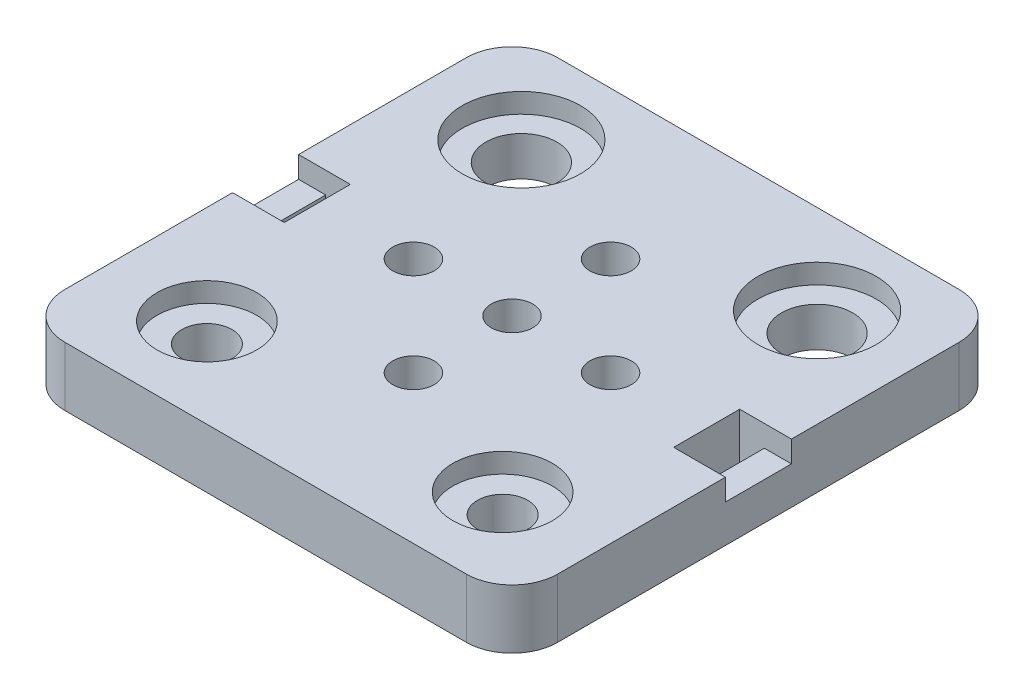
ISO-10303-21;
HEADER;
FILE_DESCRIPTION(('STEP AP214'),'2;1');
FILE_NAME('part.step','',(''),(''),'','','');
FILE_SCHEMA(('AUTOMOTIVE_DESIGN { 1 0 10303 214 1 1 1 1 }'));
ENDSEC;
DATA;
#1=APPLICATION_CONTEXT('core data for automotive mechanical design processes');
#2=APPLICATION_PROTOCOL_DEFINITION('international standard','automotive_design',2000,#1);
#3=PRODUCT_CONTEXT('',#1,'mechanical');
#4=PRODUCT('Part','Part','',(#3));
#5=PRODUCT_RELATED_PRODUCT_CATEGORY('part','',(#4));
#6=PRODUCT_DEFINITION_FORMATION('','',#4);
#7=PRODUCT_DEFINITION_CONTEXT('part definition',#1,'design');
#8=PRODUCT_DEFINITION('design','',#6,#7);
#9=PRODUCT_DEFINITION_SHAPE('','',#8);
#10=(LENGTH_UNIT() NAMED_UNIT(*) SI_UNIT(.MILLI.,.METRE.));
#11=(NAMED_UNIT(*) PLANE_ANGLE_UNIT() SI_UNIT($,.RADIAN.));
#12=(NAMED_UNIT(*) SI_UNIT($,.STERADIAN.) SOLID_ANGLE_UNIT());
#13=UNCERTAINTY_MEASURE_WITH_UNIT(LENGTH_MEASURE(1.E-05),#10,'distance_accuracy_value','');
#14=(GEOMETRIC_REPRESENTATION_CONTEXT(3) GLOBAL_UNCERTAINTY_ASSIGNED_CONTEXT((#13)) GLOBAL_UNIT_ASSIGNED_CONTEXT((#10,
#11,#12)) REPRESENTATION_CONTEXT('',''));
#15=CARTESIAN_POINT('',(0.,0.,0.));
#16=DIRECTION('',(0.,0.,1.));
#17=DIRECTION('',(1.,0.,0.));
#18=AXIS2_PLACEMENT_3D('',#15,#16,#17);
#19=CARTESIAN_POINT('',(-15.,6.,15.95));
#20=DIRECTION('',(0.,-1.,0.));
#21=DIRECTION('',(0.,0.,-1.));
#22=AXIS2_PLACEMENT_3D('',#19,#20,#21);
#23=CYLINDRICAL_SURFACE('',#22,2.55);
#24=CARTESIAN_POINT('',(-15.,0.,15.95));
#25=DIRECTION('',(0.,1.,0.));
#26=DIRECTION('',(0.,0.,-1.));
#27=AXIS2_PLACEMENT_3D('',#24,#25,#26);
#28=CIRCLE('',#27,2.55);
#29=CARTESIAN_POINT('',(-15.,0.,13.4));
#30=VERTEX_POINT('',#29);
#31=EDGE_CURVE('E324',#30,#30,#28,.T.);
#32=ORIENTED_EDGE('',*,*,#31,.F.);
#33=EDGE_LOOP('',(#32));
#34=FACE_BOUND('',#33,.T.);
#35=CARTESIAN_POINT('',(-15.,4.,15.95));
#36=DIRECTION('',(0.,1.,0.));
#37=DIRECTION('',(0.,0.,1.));
#38=AXIS2_PLACEMENT_3D('',#35,#36,#37);
#39=CIRCLE('',#38,2.55);
#40=CARTESIAN_POINT('',(-15.,4.,18.5));
#41=VERTEX_POINT('',#40);
#42=EDGE_CURVE('E39',#41,#41,#39,.T.);
#43=ORIENTED_EDGE('',*,*,#42,.T.);
#44=EDGE_LOOP('',(#43));
#45=FACE_BOUND('',#44,.T.);
#46=ADVANCED_FACE('F35',(#34,#45),#23,.F.);
#47=CARTESIAN_POINT('',(15.,6.,15.95));
#48=DIRECTION('',(0.,-1.,0.));
#49=DIRECTION('',(0.,0.,-1.));
#50=AXIS2_PLACEMENT_3D('',#47,#48,#49);
#51=CYLINDRICAL_SURFACE('',#50,2.55);
#52=CARTESIAN_POINT('',(15.,0.,15.95));
#53=DIRECTION('',(0.,1.,0.));
#54=DIRECTION('',(0.,0.,1.));
#55=AXIS2_PLACEMENT_3D('',#52,#53,#54);
#56=CIRCLE('',#55,2.55);
#57=CARTESIAN_POINT('',(15.,0.,18.5));
#58=VERTEX_POINT('',#57);
#59=EDGE_CURVE('E327',#58,#58,#56,.T.);
#60=ORIENTED_EDGE('',*,*,#59,.F.);
#61=EDGE_LOOP('',(#60));
#62=FACE_BOUND('',#61,.T.);
#63=CARTESIAN_POINT('',(15.,4.,15.95));
#64=DIRECTION('',(0.,1.,0.));
#65=DIRECTION('',(0.,0.,1.));
#66=AXIS2_PLACEMENT_3D('',#63,#64,#65);
#67=CIRCLE('',#66,2.55);
#68=CARTESIAN_POINT('',(15.,4.,18.5));
#69=VERTEX_POINT('',#68);
#70=EDGE_CURVE('E276',#69,#69,#67,.T.);
#71=ORIENTED_EDGE('',*,*,#70,.T.);
#72=EDGE_LOOP('',(#71));
#73=FACE_BOUND('',#72,.T.);
#74=ADVANCED_FACE('F400',(#62,#73),#51,.F.);
#75=CARTESIAN_POINT('',(15.,6.,-15.95));
#76=DIRECTION('',(0.,-1.,0.));
#77=DIRECTION('',(0.,0.,-1.));
#78=AXIS2_PLACEMENT_3D('',#75,#76,#77);
#79=CYLINDRICAL_SURFACE('',#78,3.6);
#80=CARTESIAN_POINT('',(15.,0.,-15.95));
#81=DIRECTION('',(0.,1.,0.));
#82=DIRECTION('',(0.,0.,-1.));
#83=AXIS2_PLACEMENT_3D('',#80,#81,#82);
#84=CIRCLE('',#83,3.6);
#85=CARTESIAN_POINT('',(15.,0.,-19.55));
#86=VERTEX_POINT('',#85);
#87=EDGE_CURVE('E330',#86,#86,#84,.T.);
#88=ORIENTED_EDGE('',*,*,#87,.F.);
#89=EDGE_LOOP('',(#88));
#90=FACE_BOUND('',#89,.T.);
#91=CARTESIAN_POINT('',(15.,4.,-15.95));
#92=DIRECTION('',(0.,1.,0.));
#93=DIRECTION('',(0.,0.,1.));
#94=AXIS2_PLACEMENT_3D('',#91,#92,#93);
#95=CIRCLE('',#94,3.6);
#96=CARTESIAN_POINT('',(15.,4.,-12.35));
#97=VERTEX_POINT('',#96);
#98=EDGE_CURVE('E283',#97,#97,#95,.T.);
#99=ORIENTED_EDGE('',*,*,#98,.T.);
#100=EDGE_LOOP('',(#99));
#101=FACE_BOUND('',#100,.T.);
#102=ADVANCED_FACE('F459',(#90,#101),#79,.F.);
#103=CARTESIAN_POINT('',(-15.,6.,-15.95));
#104=DIRECTION('',(0.,-1.,0.));
#105=DIRECTION('',(0.,0.,-1.));
#106=AXIS2_PLACEMENT_3D('',#103,#104,#105);
#107=CYLINDRICAL_SURFACE('',#106,3.6);
#108=CARTESIAN_POINT('',(-15.,0.,-15.95));
#109=DIRECTION('',(0.,1.,0.));
#110=DIRECTION('',(0.,0.,1.));
#111=AXIS2_PLACEMENT_3D('',#108,#109,#110);
#112=CIRCLE('',#111,3.6);
#113=CARTESIAN_POINT('',(-15.,0.,-12.35));
#114=VERTEX_POINT('',#113);
#115=EDGE_CURVE('E333',#114,#114,#112,.T.);
#116=ORIENTED_EDGE('',*,*,#115,.F.);
#117=EDGE_LOOP('',(#116));
#118=FACE_BOUND('',#117,.T.);
#119=CARTESIAN_POINT('',(-15.,4.,-15.95));
#120=DIRECTION('',(0.,1.,0.));
#121=DIRECTION('',(0.,0.,1.));
#122=AXIS2_PLACEMENT_3D('',#119,#120,#121);
#123=CIRCLE('',#122,3.6);
#124=CARTESIAN_POINT('',(-15.,4.,-12.35));
#125=VERTEX_POINT('',#124);
#126=EDGE_CURVE('E290',#125,#125,#123,.T.);
#127=ORIENTED_EDGE('',*,*,#126,.T.);
#128=EDGE_LOOP('',(#127));
#129=FACE_BOUND('',#128,.T.);
#130=ADVANCED_FACE('F419',(#118,#129),#107,.F.);
#131=CARTESIAN_POINT('',(-20.365,6.,-20.365));
#132=DIRECTION('',(0.,1.,0.));
#133=DIRECTION('',(0.,0.,1.));
#134=AXIS2_PLACEMENT_3D('',#131,#132,#133);
#135=PLANE('',#134);
#136=DIRECTION('',(-1.,0.,0.));
#137=VECTOR('',#136,1.);
#138=CARTESIAN_POINT('',(25.,6.,-3.35));
#139=LINE('',#138,#137);
#140=CARTESIAN_POINT('',(25.,6.,-3.35));
#141=VERTEX_POINT('',#140);
#142=CARTESIAN_POINT('',(19.75,6.,-3.35));
#143=VERTEX_POINT('',#142);
#144=EDGE_CURVE('E181',#141,#143,#139,.T.);
#145=ORIENTED_EDGE('',*,*,#144,.F.);
#146=DIRECTION('',(0.,0.,-1.));
#147=VECTOR('',#146,1.);
#148=CARTESIAN_POINT('',(25.,6.,20.365));
#149=LINE('',#148,#147);
#150=CARTESIAN_POINT('',(25.,6.,-20.365));
#151=VERTEX_POINT('',#150);
#152=EDGE_CURVE('E351',#141,#151,#149,.T.);
#153=ORIENTED_EDGE('',*,*,#152,.T.);
#154=CARTESIAN_POINT('',(20.365,6.,-20.365));
#155=DIRECTION('',(0.,1.,0.));
#156=DIRECTION('',(0.,0.,1.));
#157=AXIS2_PLACEMENT_3D('',#154,#155,#156);
#158=CIRCLE('',#157,4.635);
#159=CARTESIAN_POINT('',(20.365,6.,-25.));
#160=VERTEX_POINT('',#159);
#161=EDGE_CURVE('E355',#151,#160,#158,.T.);
#162=ORIENTED_EDGE('',*,*,#161,.T.);
#163=DIRECTION('',(-1.,0.,0.));
#164=VECTOR('',#163,1.);
#165=CARTESIAN_POINT('',(20.365,6.,-25.));
#166=LINE('',#165,#164);
#167=CARTESIAN_POINT('',(-20.365,6.,-25.));
#168=VERTEX_POINT('',#167);
#169=EDGE_CURVE('E357',#160,#168,#166,.T.);
#170=ORIENTED_EDGE('',*,*,#169,.T.);
#171=CARTESIAN_POINT('',(-20.365,6.,-20.365));
#172=DIRECTION('',(0.,1.,0.));
#173=DIRECTION('',(0.,0.,1.));
#174=AXIS2_PLACEMENT_3D('',#171,#172,#173);
#175=CIRCLE('',#174,4.635);
#176=CARTESIAN_POINT('',(-25.,6.,-20.365));
#177=VERTEX_POINT('',#176);
#178=EDGE_CURVE('E337',#168,#177,#175,.T.);
#179=ORIENTED_EDGE('',*,*,#178,.T.);
#180=DIRECTION('',(0.,0.,1.));
#181=VECTOR('',#180,1.);
#182=CARTESIAN_POINT('',(-25.,6.,20.365));
#183=LINE('',#182,#181);
#184=CARTESIAN_POINT('',(-25.,6.,-3.35));
#185=VERTEX_POINT('',#184);
#186=EDGE_CURVE('E342',#177,#185,#183,.T.);
#187=ORIENTED_EDGE('',*,*,#186,.T.);
#188=DIRECTION('',(-1.,0.,0.));
#189=VECTOR('',#188,1.);
#190=CARTESIAN_POINT('',(-25.,6.,-3.35));
#191=LINE('',#190,#189);
#192=CARTESIAN_POINT('',(-19.75,6.,-3.35));
#193=VERTEX_POINT('',#192);
#194=EDGE_CURVE('E247',#193,#185,#191,.T.);
#195=ORIENTED_EDGE('',*,*,#194,.F.);
#196=DIRECTION('',(0.,0.,-1.));
#197=VECTOR('',#196,1.);
#198=CARTESIAN_POINT('',(-19.75,6.,-3.35));
#199=LINE('',#198,#197);
#200=CARTESIAN_POINT('',(-19.75,6.,3.35));
#201=VERTEX_POINT('',#200);
#202=EDGE_CURVE('E255',#201,#193,#199,.T.);
#203=ORIENTED_EDGE('',*,*,#202,.F.);
#204=DIRECTION('',(1.,0.,0.));
#205=VECTOR('',#204,1.);
#206=CARTESIAN_POINT('',(-25.,6.,3.35));
#207=LINE('',#206,#205);
#208=CARTESIAN_POINT('',(-25.,6.,3.35));
#209=VERTEX_POINT('',#208);
#210=EDGE_CURVE('E238',#209,#201,#207,.T.);
#211=ORIENTED_EDGE('',*,*,#210,.F.);
#212=CARTESIAN_POINT('',(-25.,6.,20.365));
#213=VERTEX_POINT('',#212);
#214=EDGE_CURVE('E340',#209,#213,#183,.T.);
#215=ORIENTED_EDGE('',*,*,#214,.T.);
#216=CARTESIAN_POINT('',(-20.365,6.,20.365));
#217=DIRECTION('',(0.,1.,0.));
#218=DIRECTION('',(0.,0.,-1.));
#219=AXIS2_PLACEMENT_3D('',#216,#217,#218);
#220=CIRCLE('',#219,4.635);
#221=CARTESIAN_POINT('',(-20.365,6.,25.));
#222=VERTEX_POINT('',#221);
#223=EDGE_CURVE('E345',#213,#222,#220,.T.);
#224=ORIENTED_EDGE('',*,*,#223,.T.);
#225=DIRECTION('',(1.,0.,0.));
#226=VECTOR('',#225,1.);
#227=CARTESIAN_POINT('',(20.365,6.,25.));
#228=LINE('',#227,#226);
#229=CARTESIAN_POINT('',(20.365,6.,25.));
#230=VERTEX_POINT('',#229);
#231=EDGE_CURVE('E347',#222,#230,#228,.T.);
#232=ORIENTED_EDGE('',*,*,#231,.T.);
#233=CARTESIAN_POINT('',(20.365,6.,20.365));
#234=DIRECTION('',(0.,1.,0.));
#235=DIRECTION('',(0.,0.,1.));
#236=AXIS2_PLACEMENT_3D('',#233,#234,#235);
#237=CIRCLE('',#236,4.635);
#238=CARTESIAN_POINT('',(25.,6.,20.365));
#239=VERTEX_POINT('',#238);
#240=EDGE_CURVE('E349',#230,#239,#237,.T.);
#241=ORIENTED_EDGE('',*,*,#240,.T.);
#242=CARTESIAN_POINT('',(25.,6.,3.35));
#243=VERTEX_POINT('',#242);
#244=EDGE_CURVE('E352',#239,#243,#149,.T.);
#245=ORIENTED_EDGE('',*,*,#244,.T.);
#246=DIRECTION('',(1.,0.,0.));
#247=VECTOR('',#246,1.);
#248=CARTESIAN_POINT('',(25.,6.,3.35));
#249=LINE('',#248,#247);
#250=CARTESIAN_POINT('',(19.75,6.,3.35));
#251=VERTEX_POINT('',#250);
#252=EDGE_CURVE('E228',#251,#243,#249,.T.);
#253=ORIENTED_EDGE('',*,*,#252,.F.);
#254=DIRECTION('',(0.,0.,1.));
#255=VECTOR('',#254,1.);
#256=CARTESIAN_POINT('',(19.75,6.,-3.35));
#257=LINE('',#256,#255);
#258=EDGE_CURVE('E233',#143,#251,#257,.T.);
#259=ORIENTED_EDGE('',*,*,#258,.F.);
#260=EDGE_LOOP('',(#145,#153,#162,#170,#179,#187,#195,#203,#211,#215,#224,#232,#241,#245,#253,#259));
#261=FACE_BOUND('',#260,.T.);
#262=CARTESIAN_POINT('',(-15.,6.,15.95));
#263=DIRECTION('',(0.,1.,0.));
#264=DIRECTION('',(0.,0.,1.));
#265=AXIS2_PLACEMENT_3D('',#262,#263,#264);
#266=CIRCLE('',#265,5.05);
#267=CARTESIAN_POINT('',(-15.,6.,21.));
#268=VERTEX_POINT('',#267);
#269=EDGE_CURVE('E262',#268,#268,#266,.T.);
#270=ORIENTED_EDGE('',*,*,#269,.F.);
#271=EDGE_LOOP('',(#270));
#272=FACE_BOUND('',#271,.T.);
#273=CARTESIAN_POINT('',(15.,6.,15.95));
#274=DIRECTION('',(0.,1.,0.));
#275=DIRECTION('',(0.,0.,1.));
#276=AXIS2_PLACEMENT_3D('',#273,#274,#275);
#277=CIRCLE('',#276,5.05);
#278=CARTESIAN_POINT('',(15.,6.,21.));
#279=VERTEX_POINT('',#278);
#280=EDGE_CURVE('E277',#279,#279,#277,.T.);
#281=ORIENTED_EDGE('',*,*,#280,.F.);
#282=EDGE_LOOP('',(#281));
#283=FACE_BOUND('',#282,.T.);
#284=CARTESIAN_POINT('',(15.,6.,-15.95));
#285=DIRECTION('',(0.,1.,0.));
#286=DIRECTION('',(0.,0.,1.));
#287=AXIS2_PLACEMENT_3D('',#284,#285,#286);
#288=CIRCLE('',#287,6.00000000000001);
#289=CARTESIAN_POINT('',(15.,6.,-9.94999999999998));
#290=VERTEX_POINT('',#289);
#291=EDGE_CURVE('E284',#290,#290,#288,.T.);
#292=ORIENTED_EDGE('',*,*,#291,.F.);
#293=EDGE_LOOP('',(#292));
#294=FACE_BOUND('',#293,.T.);
#295=CARTESIAN_POINT('',(-15.,6.,-15.95));
#296=DIRECTION('',(0.,1.,0.));
#297=DIRECTION('',(0.,0.,1.));
#298=AXIS2_PLACEMENT_3D('',#295,#296,#297);
#299=CIRCLE('',#298,6.);
#300=CARTESIAN_POINT('',(-15.,6.,-9.94999999999998));
#301=VERTEX_POINT('',#300);
#302=EDGE_CURVE('E291',#301,#301,#299,.T.);
#303=ORIENTED_EDGE('',*,*,#302,.F.);
#304=EDGE_LOOP('',(#303));
#305=FACE_BOUND('',#304,.T.);
#306=CARTESIAN_POINT('',(0.,6.,-10.));
#307=DIRECTION('',(0.,1.,0.));
#308=DIRECTION('',(0.,0.,1.));
#309=AXIS2_PLACEMENT_3D('',#306,#307,#308);
#310=CIRCLE('',#309,2.1);
#311=CARTESIAN_POINT('',(0.,6.,-7.9));
#312=VERTEX_POINT('',#311);
#313=EDGE_CURVE('E294',#312,#312,#310,.T.);
#314=ORIENTED_EDGE('',*,*,#313,.F.);
#315=EDGE_LOOP('',(#314));
#316=FACE_BOUND('',#315,.T.);
#317=CARTESIAN_POINT('',(-10.,6.,0.));
#318=DIRECTION('',(0.,1.,0.));
#319=DIRECTION('',(0.,0.,1.));
#320=AXIS2_PLACEMENT_3D('',#317,#318,#319);
#321=CIRCLE('',#320,2.1);
#322=CARTESIAN_POINT('',(-10.,6.,2.1));
#323=VERTEX_POINT('',#322);
#324=EDGE_CURVE('E300',#323,#323,#321,.T.);
#325=ORIENTED_EDGE('',*,*,#324,.F.);
#326=EDGE_LOOP('',(#325));
#327=FACE_BOUND('',#326,.T.);
#328=CARTESIAN_POINT('',(0.,6.,0.));
#329=DIRECTION('',(0.,1.,0.));
#330=DIRECTION('',(0.,0.,1.));
#331=AXIS2_PLACEMENT_3D('',#328,#329,#330);
#332=CIRCLE('',#331,2.1);
#333=CARTESIAN_POINT('',(0.,6.,2.1));
#334=VERTEX_POINT('',#333);
#335=EDGE_CURVE('E306',#334,#334,#332,.T.);
#336=ORIENTED_EDGE('',*,*,#335,.F.);
#337=EDGE_LOOP('',(#336));
#338=FACE_BOUND('',#337,.T.);
#339=CARTESIAN_POINT('',(0.,6.,10.));
#340=DIRECTION('',(0.,1.,0.));
#341=DIRECTION('',(0.,0.,1.));
#342=AXIS2_PLACEMENT_3D('',#339,#340,#341);
#343=CIRCLE('',#342,2.1);
#344=CARTESIAN_POINT('',(0.,6.,12.1));
#345=VERTEX_POINT('',#344);
#346=EDGE_CURVE('E312',#345,#345,#343,.T.);
#347=ORIENTED_EDGE('',*,*,#346,.F.);
#348=EDGE_LOOP('',(#347));
#349=FACE_BOUND('',#348,.T.);
#350=CARTESIAN_POINT('',(10.,6.,0.));
#351=DIRECTION('',(0.,1.,0.));
#352=DIRECTION('',(0.,0.,1.));
#353=AXIS2_PLACEMENT_3D('',#350,#351,#352);
#354=CIRCLE('',#353,2.1);
#355=CARTESIAN_POINT('',(10.,6.,2.1));
#356=VERTEX_POINT('',#355);
#357=EDGE_CURVE('E318',#356,#356,#354,.T.);
#358=ORIENTED_EDGE('',*,*,#357,.F.);
#359=EDGE_LOOP('',(#358));
#360=FACE_BOUND('',#359,.T.);
#361=ADVANCED_FACE('F416',(#261,#272,#283,#294,#305,#316,#327,#338,#349,#360),#135,.T.);
#362=CARTESIAN_POINT('',(-20.365,0.,-20.365));
#363=DIRECTION('',(0.,1.,0.));
#364=DIRECTION('',(0.,0.,1.));
#365=AXIS2_PLACEMENT_3D('',#362,#363,#364);
#366=PLANE('',#365);
#367=DIRECTION('',(0.,0.,-1.));
#368=VECTOR('',#367,1.);
#369=CARTESIAN_POINT('',(22.25,0.,-3.35));
#370=LINE('',#369,#368);
#371=CARTESIAN_POINT('',(22.25,0.,3.35));
#372=VERTEX_POINT('',#371);
#373=CARTESIAN_POINT('',(22.25,0.,-3.35));
#374=VERTEX_POINT('',#373);
#375=EDGE_CURVE('E195',#372,#374,#370,.T.);
#376=ORIENTED_EDGE('',*,*,#375,.T.);
#377=DIRECTION('',(-1.,0.,0.));
#378=VECTOR('',#377,1.);
#379=CARTESIAN_POINT('',(19.75,0.,-3.35));
#380=LINE('',#379,#378);
#381=CARTESIAN_POINT('',(19.75,0.,-3.35));
#382=VERTEX_POINT('',#381);
#383=EDGE_CURVE('E178',#374,#382,#380,.T.);
#384=ORIENTED_EDGE('',*,*,#383,.T.);
#385=DIRECTION('',(0.,0.,1.));
#386=VECTOR('',#385,1.);
#387=CARTESIAN_POINT('',(19.75,0.,-3.35));
#388=LINE('',#387,#386);
#389=CARTESIAN_POINT('',(19.75,0.,3.35));
#390=VERTEX_POINT('',#389);
#391=EDGE_CURVE('E186',#382,#390,#388,.T.);
#392=ORIENTED_EDGE('',*,*,#391,.T.);
#393=DIRECTION('',(1.,0.,0.));
#394=VECTOR('',#393,1.);
#395=CARTESIAN_POINT('',(19.75,0.,3.35));
#396=LINE('',#395,#394);
#397=EDGE_CURVE('E190',#390,#372,#396,.T.);
#398=ORIENTED_EDGE('',*,*,#397,.T.);
#399=EDGE_LOOP('',(#376,#384,#392,#398));
#400=FACE_BOUND('',#399,.T.);
#401=DIRECTION('',(1.,0.,0.));
#402=VECTOR('',#401,1.);
#403=CARTESIAN_POINT('',(-19.75,0.,3.35));
#404=LINE('',#403,#402);
#405=CARTESIAN_POINT('',(-22.25,0.,3.35));
#406=VERTEX_POINT('',#405);
#407=CARTESIAN_POINT('',(-19.75,0.,3.35));
#408=VERTEX_POINT('',#407);
#409=EDGE_CURVE('E215',#406,#408,#404,.T.);
#410=ORIENTED_EDGE('',*,*,#409,.T.);
#411=DIRECTION('',(0.,0.,-1.));
#412=VECTOR('',#411,1.);
#413=CARTESIAN_POINT('',(-19.75,0.,-3.35));
#414=LINE('',#413,#412);
#415=CARTESIAN_POINT('',(-19.75,0.,-3.35));
#416=VERTEX_POINT('',#415);
#417=EDGE_CURVE('E208',#408,#416,#414,.T.);
#418=ORIENTED_EDGE('',*,*,#417,.T.);
#419=DIRECTION('',(-1.,0.,0.));
#420=VECTOR('',#419,1.);
#421=CARTESIAN_POINT('',(-19.75,0.,-3.35));
#422=LINE('',#421,#420);
#423=CARTESIAN_POINT('',(-22.25,0.,-3.35));
#424=VERTEX_POINT('',#423);
#425=EDGE_CURVE('E211',#416,#424,#422,.T.);
#426=ORIENTED_EDGE('',*,*,#425,.T.);
#427=DIRECTION('',(0.,0.,1.));
#428=VECTOR('',#427,1.);
#429=CARTESIAN_POINT('',(-22.25,0.,-3.35));
#430=LINE('',#429,#428);
#431=EDGE_CURVE('E60',#424,#406,#430,.T.);
#432=ORIENTED_EDGE('',*,*,#431,.T.);
#433=EDGE_LOOP('',(#410,#418,#426,#432));
#434=FACE_BOUND('',#433,.T.);
#435=CARTESIAN_POINT('',(0.,0.,-10.));
#436=DIRECTION('',(0.,1.,0.));
#437=DIRECTION('',(0.,0.,1.));
#438=AXIS2_PLACEMENT_3D('',#435,#436,#437);
#439=CIRCLE('',#438,2.1);
#440=CARTESIAN_POINT('',(0.,0.,-7.9));
#441=VERTEX_POINT('',#440);
#442=EDGE_CURVE('E297',#441,#441,#439,.T.);
#443=ORIENTED_EDGE('',*,*,#442,.T.);
#444=EDGE_LOOP('',(#443));
#445=FACE_BOUND('',#444,.T.);
#446=CARTESIAN_POINT('',(-10.,0.,0.));
#447=DIRECTION('',(0.,1.,0.));
#448=DIRECTION('',(0.,0.,1.));
#449=AXIS2_PLACEMENT_3D('',#446,#447,#448);
#450=CIRCLE('',#449,2.1);
#451=CARTESIAN_POINT('',(-10.,0.,2.1));
#452=VERTEX_POINT('',#451);
#453=EDGE_CURVE('E303',#452,#452,#450,.T.);
#454=ORIENTED_EDGE('',*,*,#453,.T.);
#455=EDGE_LOOP('',(#454));
#456=FACE_BOUND('',#455,.T.);
#457=CARTESIAN_POINT('',(0.,0.,0.));
#458=DIRECTION('',(0.,1.,0.));
#459=DIRECTION('',(0.,0.,1.));
#460=AXIS2_PLACEMENT_3D('',#457,#458,#459);
#461=CIRCLE('',#460,2.1);
#462=CARTESIAN_POINT('',(0.,0.,2.1));
#463=VERTEX_POINT('',#462);
#464=EDGE_CURVE('E309',#463,#463,#461,.T.);
#465=ORIENTED_EDGE('',*,*,#464,.T.);
#466=EDGE_LOOP('',(#465));
#467=FACE_BOUND('',#466,.T.);
#468=CARTESIAN_POINT('',(0.,0.,10.));
#469=DIRECTION('',(0.,1.,0.));
#470=DIRECTION('',(0.,0.,1.));
#471=AXIS2_PLACEMENT_3D('',#468,#469,#470);
#472=CIRCLE('',#471,2.1);
#473=CARTESIAN_POINT('',(0.,0.,12.1));
#474=VERTEX_POINT('',#473);
#475=EDGE_CURVE('E315',#474,#474,#472,.T.);
#476=ORIENTED_EDGE('',*,*,#475,.T.);
#477=EDGE_LOOP('',(#476));
#478=FACE_BOUND('',#477,.T.);
#479=CARTESIAN_POINT('',(10.,0.,0.));
#480=DIRECTION('',(0.,1.,0.));
#481=DIRECTION('',(0.,0.,1.));
#482=AXIS2_PLACEMENT_3D('',#479,#480,#481);
#483=CIRCLE('',#482,2.1);
#484=CARTESIAN_POINT('',(10.,0.,2.1));
#485=VERTEX_POINT('',#484);
#486=EDGE_CURVE('E321',#485,#485,#483,.T.);
#487=ORIENTED_EDGE('',*,*,#486,.T.);
#488=EDGE_LOOP('',(#487));
#489=FACE_BOUND('',#488,.T.);
#490=ORIENTED_EDGE('',*,*,#59,.T.);
#491=EDGE_LOOP('',(#490));
#492=FACE_BOUND('',#491,.T.);
#493=ORIENTED_EDGE('',*,*,#115,.T.);
#494=EDGE_LOOP('',(#493));
#495=FACE_BOUND('',#494,.T.);
#496=CARTESIAN_POINT('',(-20.365,0.,-20.365));
#497=DIRECTION('',(0.,1.,0.));
#498=DIRECTION('',(0.,0.,1.));
#499=AXIS2_PLACEMENT_3D('',#496,#497,#498);
#500=CIRCLE('',#499,4.635);
#501=CARTESIAN_POINT('',(-20.365,0.,-25.));
#502=VERTEX_POINT('',#501);
#503=CARTESIAN_POINT('',(-25.,0.,-20.365));
#504=VERTEX_POINT('',#503);
#505=EDGE_CURVE('E336',#502,#504,#500,.T.);
#506=ORIENTED_EDGE('',*,*,#505,.F.);
#507=DIRECTION('',(-1.,0.,0.));
#508=VECTOR('',#507,1.);
#509=CARTESIAN_POINT('',(20.365,0.,-25.));
#510=LINE('',#509,#508);
#511=CARTESIAN_POINT('',(20.365,0.,-25.));
#512=VERTEX_POINT('',#511);
#513=EDGE_CURVE('E341',#512,#502,#510,.T.);
#514=ORIENTED_EDGE('',*,*,#513,.F.);
#515=CARTESIAN_POINT('',(20.365,0.,-20.365));
#516=DIRECTION('',(0.,1.,0.));
#517=DIRECTION('',(0.,0.,1.));
#518=AXIS2_PLACEMENT_3D('',#515,#516,#517);
#519=CIRCLE('',#518,4.635);
#520=CARTESIAN_POINT('',(25.,0.,-20.365));
#521=VERTEX_POINT('',#520);
#522=EDGE_CURVE('E372',#521,#512,#519,.T.);
#523=ORIENTED_EDGE('',*,*,#522,.F.);
#524=DIRECTION('',(0.,0.,-1.));
#525=VECTOR('',#524,1.);
#526=CARTESIAN_POINT('',(25.,0.,20.365));
#527=LINE('',#526,#525);
#528=CARTESIAN_POINT('',(25.,0.,20.365));
#529=VERTEX_POINT('',#528);
#530=EDGE_CURVE('E370',#529,#521,#527,.T.);
#531=ORIENTED_EDGE('',*,*,#530,.F.);
#532=CARTESIAN_POINT('',(20.365,0.,20.365));
#533=DIRECTION('',(0.,1.,0.));
#534=DIRECTION('',(0.,0.,1.));
#535=AXIS2_PLACEMENT_3D('',#532,#533,#534);
#536=CIRCLE('',#535,4.635);
#537=CARTESIAN_POINT('',(20.365,0.,25.));
#538=VERTEX_POINT('',#537);
#539=EDGE_CURVE('E368',#538,#529,#536,.T.);
#540=ORIENTED_EDGE('',*,*,#539,.F.);
#541=DIRECTION('',(1.,0.,0.));
#542=VECTOR('',#541,1.);
#543=CARTESIAN_POINT('',(20.365,0.,25.));
#544=LINE('',#543,#542);
#545=CARTESIAN_POINT('',(-20.365,0.,25.));
#546=VERTEX_POINT('',#545);
#547=EDGE_CURVE('E366',#546,#538,#544,.T.);
#548=ORIENTED_EDGE('',*,*,#547,.F.);
#549=CARTESIAN_POINT('',(-20.365,0.,20.365));
#550=DIRECTION('',(0.,1.,0.));
#551=DIRECTION('',(0.,0.,-1.));
#552=AXIS2_PLACEMENT_3D('',#549,#550,#551);
#553=CIRCLE('',#552,4.635);
#554=CARTESIAN_POINT('',(-25.,0.,20.365));
#555=VERTEX_POINT('',#554);
#556=EDGE_CURVE('E364',#555,#546,#553,.T.);
#557=ORIENTED_EDGE('',*,*,#556,.F.);
#558=DIRECTION('',(0.,0.,1.));
#559=VECTOR('',#558,1.);
#560=CARTESIAN_POINT('',(-25.,0.,20.365));
#561=LINE('',#560,#559);
#562=EDGE_CURVE('E362',#504,#555,#561,.T.);
#563=ORIENTED_EDGE('',*,*,#562,.F.);
#564=EDGE_LOOP('',(#506,#514,#523,#531,#540,#548,#557,#563));
#565=FACE_BOUND('',#564,.T.);
#566=ORIENTED_EDGE('',*,*,#87,.T.);
#567=EDGE_LOOP('',(#566));
#568=FACE_BOUND('',#567,.T.);
#569=ORIENTED_EDGE('',*,*,#31,.T.);
#570=EDGE_LOOP('',(#569));
#571=FACE_BOUND('',#570,.T.);
#572=ADVANCED_FACE('F192',(#400,#434,#445,#456,#467,#478,#489,#492,#495,#565,#568,#571),#366,.F.);
#573=CARTESIAN_POINT('',(-20.365,6.,-20.365));
#574=DIRECTION('',(0.,-1.,0.));
#575=DIRECTION('',(0.,0.,-1.));
#576=AXIS2_PLACEMENT_3D('',#573,#574,#575);
#577=CYLINDRICAL_SURFACE('',#576,4.635);
#578=ORIENTED_EDGE('',*,*,#505,.T.);
#579=DIRECTION('',(0.,-1.,0.));
#580=VECTOR('',#579,1.);
#581=CARTESIAN_POINT('',(-25.,6.,-20.365));
#582=LINE('',#581,#580);
#583=EDGE_CURVE('E11',#177,#504,#582,.T.);
#584=ORIENTED_EDGE('',*,*,#583,.F.);
#585=ORIENTED_EDGE('',*,*,#178,.F.);
#586=DIRECTION('',(0.,-1.,0.));
#587=VECTOR('',#586,1.);
#588=CARTESIAN_POINT('',(-20.365,6.,-25.));
#589=LINE('',#588,#587);
#590=EDGE_CURVE('E359',#168,#502,#589,.T.);
#591=ORIENTED_EDGE('',*,*,#590,.T.);
#592=EDGE_LOOP('',(#578,#584,#585,#591));
#593=FACE_BOUND('',#592,.T.);
#594=ADVANCED_FACE('F37',(#593),#577,.T.);
#595=CARTESIAN_POINT('',(-25.,6.,20.365));
#596=DIRECTION('',(1.,0.,0.));
#597=DIRECTION('',(0.,0.,-1.));
#598=AXIS2_PLACEMENT_3D('',#595,#596,#597);
#599=PLANE('',#598);
#600=DIRECTION('',(0.,0.,1.));
#601=VECTOR('',#600,1.);
#602=CARTESIAN_POINT('',(-25.,3.82,-3.35));
#603=LINE('',#602,#601);
#604=CARTESIAN_POINT('',(-25.,3.82,-3.35));
#605=VERTEX_POINT('',#604);
#606=CARTESIAN_POINT('',(-25.,3.82,3.35));
#607=VERTEX_POINT('',#606);
#608=EDGE_CURVE('E243',#605,#607,#603,.T.);
#609=ORIENTED_EDGE('',*,*,#608,.F.);
#610=DIRECTION('',(0.,1.,0.));
#611=VECTOR('',#610,1.);
#612=CARTESIAN_POINT('',(-25.,3.82,-3.35));
#613=LINE('',#612,#611);
#614=EDGE_CURVE('E259',#605,#185,#613,.T.);
#615=ORIENTED_EDGE('',*,*,#614,.T.);
#616=ORIENTED_EDGE('',*,*,#186,.F.);
#617=ORIENTED_EDGE('',*,*,#583,.T.);
#618=ORIENTED_EDGE('',*,*,#562,.T.);
#619=DIRECTION('',(0.,-1.,0.));
#620=VECTOR('',#619,1.);
#621=CARTESIAN_POINT('',(-25.,6.,20.365));
#622=LINE('',#621,#620);
#623=EDGE_CURVE('E44',#213,#555,#622,.T.);
#624=ORIENTED_EDGE('',*,*,#623,.F.);
#625=ORIENTED_EDGE('',*,*,#214,.F.);
#626=DIRECTION('',(0.,1.,0.));
#627=VECTOR('',#626,1.);
#628=CARTESIAN_POINT('',(-25.,3.82,3.35));
#629=LINE('',#628,#627);
#630=EDGE_CURVE('E252',#607,#209,#629,.T.);
#631=ORIENTED_EDGE('',*,*,#630,.F.);
#632=EDGE_LOOP('',(#609,#615,#616,#617,#618,#624,#625,#631));
#633=FACE_BOUND('',#632,.T.);
#634=ADVANCED_FACE('F490',(#633),#599,.F.);
#635=CARTESIAN_POINT('',(-20.365,6.,20.365));
#636=DIRECTION('',(0.,-1.,0.));
#637=DIRECTION('',(0.,0.,-1.));
#638=AXIS2_PLACEMENT_3D('',#635,#636,#637);
#639=CYLINDRICAL_SURFACE('',#638,4.635);
#640=ORIENTED_EDGE('',*,*,#556,.T.);
#641=DIRECTION('',(0.,-1.,0.));
#642=VECTOR('',#641,1.);
#643=CARTESIAN_POINT('',(-20.365,6.,25.));
#644=LINE('',#643,#642);
#645=EDGE_CURVE('E389',#222,#546,#644,.T.);
#646=ORIENTED_EDGE('',*,*,#645,.F.);
#647=ORIENTED_EDGE('',*,*,#223,.F.);
#648=ORIENTED_EDGE('',*,*,#623,.T.);
#649=EDGE_LOOP('',(#640,#646,#647,#648));
#650=FACE_BOUND('',#649,.T.);
#651=ADVANCED_FACE('F487',(#650),#639,.T.);
#652=CARTESIAN_POINT('',(20.365,6.,25.));
#653=DIRECTION('',(0.,0.,-1.));
#654=DIRECTION('',(-1.,0.,0.));
#655=AXIS2_PLACEMENT_3D('',#652,#653,#654);
#656=PLANE('',#655);
#657=ORIENTED_EDGE('',*,*,#547,.T.);
#658=DIRECTION('',(0.,-1.,0.));
#659=VECTOR('',#658,1.);
#660=CARTESIAN_POINT('',(20.365,6.,25.));
#661=LINE('',#660,#659);
#662=EDGE_CURVE('E386',#230,#538,#661,.T.);
#663=ORIENTED_EDGE('',*,*,#662,.F.);
#664=ORIENTED_EDGE('',*,*,#231,.F.);
#665=ORIENTED_EDGE('',*,*,#645,.T.);
#666=EDGE_LOOP('',(#657,#663,#664,#665));
#667=FACE_BOUND('',#666,.T.);
#668=ADVANCED_FACE('F483',(#667),#656,.F.);
#669=CARTESIAN_POINT('',(20.365,6.,20.365));
#670=DIRECTION('',(0.,-1.,0.));
#671=DIRECTION('',(0.,0.,-1.));
#672=AXIS2_PLACEMENT_3D('',#669,#670,#671);
#673=CYLINDRICAL_SURFACE('',#672,4.635);
#674=ORIENTED_EDGE('',*,*,#539,.T.);
#675=DIRECTION('',(0.,-1.,0.));
#676=VECTOR('',#675,1.);
#677=CARTESIAN_POINT('',(25.,6.,20.365));
#678=LINE('',#677,#676);
#679=EDGE_CURVE('E383',#239,#529,#678,.T.);
#680=ORIENTED_EDGE('',*,*,#679,.F.);
#681=ORIENTED_EDGE('',*,*,#240,.F.);
#682=ORIENTED_EDGE('',*,*,#662,.T.);
#683=EDGE_LOOP('',(#674,#680,#681,#682));
#684=FACE_BOUND('',#683,.T.);
#685=ADVANCED_FACE('F479',(#684),#673,.T.);
#686=CARTESIAN_POINT('',(25.,6.,20.365));
#687=DIRECTION('',(-1.,0.,0.));
#688=DIRECTION('',(0.,0.,1.));
#689=AXIS2_PLACEMENT_3D('',#686,#687,#688);
#690=PLANE('',#689);
#691=ORIENTED_EDGE('',*,*,#152,.F.);
#692=DIRECTION('',(0.,1.,0.));
#693=VECTOR('',#692,1.);
#694=CARTESIAN_POINT('',(25.,3.82,-3.35));
#695=LINE('',#694,#693);
#696=CARTESIAN_POINT('',(25.,3.82,-3.35));
#697=VERTEX_POINT('',#696);
#698=EDGE_CURVE('E236',#697,#141,#695,.T.);
#699=ORIENTED_EDGE('',*,*,#698,.F.);
#700=DIRECTION('',(0.,0.,-1.));
#701=VECTOR('',#700,1.);
#702=CARTESIAN_POINT('',(25.,3.82,-3.35));
#703=LINE('',#702,#701);
#704=CARTESIAN_POINT('',(25.,3.82,3.35));
#705=VERTEX_POINT('',#704);
#706=EDGE_CURVE('E183',#705,#697,#703,.T.);
#707=ORIENTED_EDGE('',*,*,#706,.F.);
#708=DIRECTION('',(0.,1.,0.));
#709=VECTOR('',#708,1.);
#710=CARTESIAN_POINT('',(25.,3.82,3.35));
#711=LINE('',#710,#709);
#712=EDGE_CURVE('E239',#705,#243,#711,.T.);
#713=ORIENTED_EDGE('',*,*,#712,.T.);
#714=ORIENTED_EDGE('',*,*,#244,.F.);
#715=ORIENTED_EDGE('',*,*,#679,.T.);
#716=ORIENTED_EDGE('',*,*,#530,.T.);
#717=DIRECTION('',(0.,-1.,0.));
#718=VECTOR('',#717,1.);
#719=CARTESIAN_POINT('',(25.,6.,-20.365));
#720=LINE('',#719,#718);
#721=EDGE_CURVE('E380',#151,#521,#720,.T.);
#722=ORIENTED_EDGE('',*,*,#721,.F.);
#723=EDGE_LOOP('',(#691,#699,#707,#713,#714,#715,#716,#722));
#724=FACE_BOUND('',#723,.T.);
#725=ADVANCED_FACE('F475',(#724),#690,.F.);
#726=CARTESIAN_POINT('',(20.365,6.,-20.365));
#727=DIRECTION('',(0.,-1.,0.));
#728=DIRECTION('',(0.,0.,-1.));
#729=AXIS2_PLACEMENT_3D('',#726,#727,#728);
#730=CYLINDRICAL_SURFACE('',#729,4.635);
#731=ORIENTED_EDGE('',*,*,#522,.T.);
#732=DIRECTION('',(0.,-1.,0.));
#733=VECTOR('',#732,1.);
#734=CARTESIAN_POINT('',(20.365,6.,-25.));
#735=LINE('',#734,#733);
#736=EDGE_CURVE('E377',#160,#512,#735,.T.);
#737=ORIENTED_EDGE('',*,*,#736,.F.);
#738=ORIENTED_EDGE('',*,*,#161,.F.);
#739=ORIENTED_EDGE('',*,*,#721,.T.);
#740=EDGE_LOOP('',(#731,#737,#738,#739));
#741=FACE_BOUND('',#740,.T.);
#742=ADVANCED_FACE('F449',(#741),#730,.T.);
#743=CARTESIAN_POINT('',(20.365,6.,-25.));
#744=DIRECTION('',(0.,0.,1.));
#745=DIRECTION('',(1.,0.,0.));
#746=AXIS2_PLACEMENT_3D('',#743,#744,#745);
#747=PLANE('',#746);
#748=ORIENTED_EDGE('',*,*,#513,.T.);
#749=ORIENTED_EDGE('',*,*,#590,.F.);
#750=ORIENTED_EDGE('',*,*,#169,.F.);
#751=ORIENTED_EDGE('',*,*,#736,.T.);
#752=EDGE_LOOP('',(#748,#749,#750,#751));
#753=FACE_BOUND('',#752,.T.);
#754=ADVANCED_FACE('F439',(#753),#747,.F.);
#755=CARTESIAN_POINT('',(10.,6.,0.));
#756=DIRECTION('',(0.,1.,0.));
#757=DIRECTION('',(0.,0.,1.));
#758=AXIS2_PLACEMENT_3D('',#755,#756,#757);
#759=CYLINDRICAL_SURFACE('',#758,2.1);
#760=ORIENTED_EDGE('',*,*,#486,.F.);
#761=EDGE_LOOP('',(#760));
#762=FACE_BOUND('',#761,.T.);
#763=ORIENTED_EDGE('',*,*,#357,.T.);
#764=EDGE_LOOP('',(#763));
#765=FACE_BOUND('',#764,.T.);
#766=ADVANCED_FACE('F436',(#762,#765),#759,.F.);
#767=CARTESIAN_POINT('',(0.,6.,10.));
#768=DIRECTION('',(0.,1.,0.));
#769=DIRECTION('',(0.,0.,1.));
#770=AXIS2_PLACEMENT_3D('',#767,#768,#769);
#771=CYLINDRICAL_SURFACE('',#770,2.1);
#772=ORIENTED_EDGE('',*,*,#475,.F.);
#773=EDGE_LOOP('',(#772));
#774=FACE_BOUND('',#773,.T.);
#775=ORIENTED_EDGE('',*,*,#346,.T.);
#776=EDGE_LOOP('',(#775));
#777=FACE_BOUND('',#776,.T.);
#778=ADVANCED_FACE('F438',(#774,#777),#771,.F.);
#779=CARTESIAN_POINT('',(0.,6.,0.));
#780=DIRECTION('',(0.,1.,0.));
#781=DIRECTION('',(0.,0.,1.));
#782=AXIS2_PLACEMENT_3D('',#779,#780,#781);
#783=CYLINDRICAL_SURFACE('',#782,2.1);
#784=ORIENTED_EDGE('',*,*,#464,.F.);
#785=EDGE_LOOP('',(#784));
#786=FACE_BOUND('',#785,.T.);
#787=ORIENTED_EDGE('',*,*,#335,.T.);
#788=EDGE_LOOP('',(#787));
#789=FACE_BOUND('',#788,.T.);
#790=ADVANCED_FACE('F446',(#786,#789),#783,.F.);
#791=CARTESIAN_POINT('',(-10.,6.,0.));
#792=DIRECTION('',(0.,1.,0.));
#793=DIRECTION('',(0.,0.,1.));
#794=AXIS2_PLACEMENT_3D('',#791,#792,#793);
#795=CYLINDRICAL_SURFACE('',#794,2.1);
#796=ORIENTED_EDGE('',*,*,#453,.F.);
#797=EDGE_LOOP('',(#796));
#798=FACE_BOUND('',#797,.T.);
#799=ORIENTED_EDGE('',*,*,#324,.T.);
#800=EDGE_LOOP('',(#799));
#801=FACE_BOUND('',#800,.T.);
#802=ADVANCED_FACE('F574',(#798,#801),#795,.F.);
#803=CARTESIAN_POINT('',(0.,6.,-10.));
#804=DIRECTION('',(0.,1.,0.));
#805=DIRECTION('',(0.,0.,1.));
#806=AXIS2_PLACEMENT_3D('',#803,#804,#805);
#807=CYLINDRICAL_SURFACE('',#806,2.1);
#808=ORIENTED_EDGE('',*,*,#442,.F.);
#809=EDGE_LOOP('',(#808));
#810=FACE_BOUND('',#809,.T.);
#811=ORIENTED_EDGE('',*,*,#313,.T.);
#812=EDGE_LOOP('',(#811));
#813=FACE_BOUND('',#812,.T.);
#814=ADVANCED_FACE('F570',(#810,#813),#807,.F.);
#815=CARTESIAN_POINT('',(-15.,4.,-15.95));
#816=DIRECTION('',(0.,1.,0.));
#817=DIRECTION('',(0.,0.,1.));
#818=AXIS2_PLACEMENT_3D('',#815,#816,#817);
#819=CYLINDRICAL_SURFACE('',#818,6.);
#820=CARTESIAN_POINT('',(-15.,4.,-15.95));
#821=DIRECTION('',(0.,1.,0.));
#822=DIRECTION('',(0.,0.,1.));
#823=AXIS2_PLACEMENT_3D('',#820,#821,#822);
#824=CIRCLE('',#823,6.);
#825=CARTESIAN_POINT('',(-15.,4.,-9.94999999999998));
#826=VERTEX_POINT('',#825);
#827=EDGE_CURVE('E287',#826,#826,#824,.T.);
#828=ORIENTED_EDGE('',*,*,#827,.F.);
#829=EDGE_LOOP('',(#828));
#830=FACE_BOUND('',#829,.T.);
#831=ORIENTED_EDGE('',*,*,#302,.T.);
#832=EDGE_LOOP('',(#831));
#833=FACE_BOUND('',#832,.T.);
#834=ADVANCED_FACE('F566',(#830,#833),#819,.F.);
#835=CARTESIAN_POINT('',(-15.,4.,-15.95));
#836=DIRECTION('',(0.,1.,0.));
#837=DIRECTION('',(0.,0.,1.));
#838=AXIS2_PLACEMENT_3D('',#835,#836,#837);
#839=PLANE('',#838);
#840=ORIENTED_EDGE('',*,*,#126,.F.);
#841=EDGE_LOOP('',(#840));
#842=FACE_BOUND('',#841,.T.);
#843=ORIENTED_EDGE('',*,*,#827,.T.);
#844=EDGE_LOOP('',(#843));
#845=FACE_BOUND('',#844,.T.);
#846=ADVANCED_FACE('F562',(#842,#845),#839,.T.);
#847=CARTESIAN_POINT('',(15.,4.,-15.95));
#848=DIRECTION('',(0.,1.,0.));
#849=DIRECTION('',(0.,0.,1.));
#850=AXIS2_PLACEMENT_3D('',#847,#848,#849);
#851=CYLINDRICAL_SURFACE('',#850,6.00000000000001);
#852=CARTESIAN_POINT('',(15.,4.,-15.95));
#853=DIRECTION('',(0.,1.,0.));
#854=DIRECTION('',(0.,0.,1.));
#855=AXIS2_PLACEMENT_3D('',#852,#853,#854);
#856=CIRCLE('',#855,6.00000000000001);
#857=CARTESIAN_POINT('',(15.,4.,-9.94999999999998));
#858=VERTEX_POINT('',#857);
#859=EDGE_CURVE('E280',#858,#858,#856,.T.);
#860=ORIENTED_EDGE('',*,*,#859,.F.);
#861=EDGE_LOOP('',(#860));
#862=FACE_BOUND('',#861,.T.);
#863=ORIENTED_EDGE('',*,*,#291,.T.);
#864=EDGE_LOOP('',(#863));
#865=FACE_BOUND('',#864,.T.);
#866=ADVANCED_FACE('F558',(#862,#865),#851,.F.);
#867=CARTESIAN_POINT('',(15.,4.,-15.95));
#868=DIRECTION('',(0.,1.,0.));
#869=DIRECTION('',(0.,0.,1.));
#870=AXIS2_PLACEMENT_3D('',#867,#868,#869);
#871=PLANE('',#870);
#872=ORIENTED_EDGE('',*,*,#98,.F.);
#873=EDGE_LOOP('',(#872));
#874=FACE_BOUND('',#873,.T.);
#875=ORIENTED_EDGE('',*,*,#859,.T.);
#876=EDGE_LOOP('',(#875));
#877=FACE_BOUND('',#876,.T.);
#878=ADVANCED_FACE('F412',(#874,#877),#871,.T.);
#879=CARTESIAN_POINT('',(15.,4.,15.95));
#880=DIRECTION('',(0.,1.,0.));
#881=DIRECTION('',(0.,0.,1.));
#882=AXIS2_PLACEMENT_3D('',#879,#880,#881);
#883=CYLINDRICAL_SURFACE('',#882,5.05);
#884=CARTESIAN_POINT('',(15.,4.,15.95));
#885=DIRECTION('',(0.,1.,0.));
#886=DIRECTION('',(0.,0.,1.));
#887=AXIS2_PLACEMENT_3D('',#884,#885,#886);
#888=CIRCLE('',#887,5.05);
#889=CARTESIAN_POINT('',(15.,4.,21.));
#890=VERTEX_POINT('',#889);
#891=EDGE_CURVE('E273',#890,#890,#888,.T.);
#892=ORIENTED_EDGE('',*,*,#891,.F.);
#893=EDGE_LOOP('',(#892));
#894=FACE_BOUND('',#893,.T.);
#895=ORIENTED_EDGE('',*,*,#280,.T.);
#896=EDGE_LOOP('',(#895));
#897=FACE_BOUND('',#896,.T.);
#898=ADVANCED_FACE('F406',(#894,#897),#883,.F.);
#899=CARTESIAN_POINT('',(15.,4.,15.95));
#900=DIRECTION('',(0.,1.,0.));
#901=DIRECTION('',(0.,0.,1.));
#902=AXIS2_PLACEMENT_3D('',#899,#900,#901);
#903=PLANE('',#902);
#904=ORIENTED_EDGE('',*,*,#70,.F.);
#905=EDGE_LOOP('',(#904));
#906=FACE_BOUND('',#905,.T.);
#907=ORIENTED_EDGE('',*,*,#891,.T.);
#908=EDGE_LOOP('',(#907));
#909=FACE_BOUND('',#908,.T.);
#910=ADVANCED_FACE('F402',(#906,#909),#903,.T.);
#911=CARTESIAN_POINT('',(-15.,4.,15.95));
#912=DIRECTION('',(0.,1.,0.));
#913=DIRECTION('',(0.,0.,1.));
#914=AXIS2_PLACEMENT_3D('',#911,#912,#913);
#915=CYLINDRICAL_SURFACE('',#914,5.05);
#916=CARTESIAN_POINT('',(-15.,4.,15.95));
#917=DIRECTION('',(0.,1.,0.));
#918=DIRECTION('',(0.,0.,1.));
#919=AXIS2_PLACEMENT_3D('',#916,#917,#918);
#920=CIRCLE('',#919,5.05);
#921=CARTESIAN_POINT('',(-15.,4.,21.));
#922=VERTEX_POINT('',#921);
#923=EDGE_CURVE('E268',#922,#922,#920,.T.);
#924=ORIENTED_EDGE('',*,*,#923,.F.);
#925=EDGE_LOOP('',(#924));
#926=FACE_BOUND('',#925,.T.);
#927=ORIENTED_EDGE('',*,*,#269,.T.);
#928=EDGE_LOOP('',(#927));
#929=FACE_BOUND('',#928,.T.);
#930=ADVANCED_FACE('F405',(#926,#929),#915,.F.);
#931=CARTESIAN_POINT('',(-15.,4.,15.95));
#932=DIRECTION('',(0.,1.,0.));
#933=DIRECTION('',(0.,0.,1.));
#934=AXIS2_PLACEMENT_3D('',#931,#932,#933);
#935=PLANE('',#934);
#936=ORIENTED_EDGE('',*,*,#42,.F.);
#937=EDGE_LOOP('',(#936));
#938=FACE_BOUND('',#937,.T.);
#939=ORIENTED_EDGE('',*,*,#923,.T.);
#940=EDGE_LOOP('',(#939));
#941=FACE_BOUND('',#940,.T.);
#942=ADVANCED_FACE('F546',(#938,#941),#935,.T.);
#943=CARTESIAN_POINT('',(-25.,3.82,-3.35));
#944=DIRECTION('',(0.,0.,-1.));
#945=DIRECTION('',(-1.,0.,0.));
#946=AXIS2_PLACEMENT_3D('',#943,#944,#945);
#947=PLANE('',#946);
#948=ORIENTED_EDGE('',*,*,#194,.T.);
#949=ORIENTED_EDGE('',*,*,#614,.F.);
#950=DIRECTION('',(-1.,0.,0.));
#951=VECTOR('',#950,1.);
#952=CARTESIAN_POINT('',(-25.,3.82,-3.35));
#953=LINE('',#952,#951);
#954=CARTESIAN_POINT('',(-22.25,3.82,-3.35));
#955=VERTEX_POINT('',#954);
#956=EDGE_CURVE('E250',#955,#605,#953,.T.);
#957=ORIENTED_EDGE('',*,*,#956,.F.);
#958=DIRECTION('',(0.,1.,0.));
#959=VECTOR('',#958,1.);
#960=CARTESIAN_POINT('',(-22.25,0.,-3.35));
#961=LINE('',#960,#959);
#962=EDGE_CURVE('E218',#424,#955,#961,.T.);
#963=ORIENTED_EDGE('',*,*,#962,.F.);
#964=ORIENTED_EDGE('',*,*,#425,.F.);
#965=DIRECTION('',(0.,1.,0.));
#966=VECTOR('',#965,1.);
#967=CARTESIAN_POINT('',(-19.75,3.82,-3.35));
#968=LINE('',#967,#966);
#969=EDGE_CURVE('E263',#416,#193,#968,.T.);
#970=ORIENTED_EDGE('',*,*,#969,.T.);
#971=EDGE_LOOP('',(#948,#949,#957,#963,#964,#970));
#972=FACE_BOUND('',#971,.T.);
#973=ADVANCED_FACE('F507',(#972),#947,.F.);
#974=CARTESIAN_POINT('',(-19.75,3.82,-3.35));
#975=DIRECTION('',(1.,0.,0.));
#976=DIRECTION('',(0.,0.,-1.));
#977=AXIS2_PLACEMENT_3D('',#974,#975,#976);
#978=PLANE('',#977);
#979=ORIENTED_EDGE('',*,*,#202,.T.);
#980=ORIENTED_EDGE('',*,*,#969,.F.);
#981=ORIENTED_EDGE('',*,*,#417,.F.);
#982=DIRECTION('',(0.,1.,0.));
#983=VECTOR('',#982,1.);
#984=CARTESIAN_POINT('',(-19.75,3.82,3.35));
#985=LINE('',#984,#983);
#986=EDGE_CURVE('E265',#408,#201,#985,.T.);
#987=ORIENTED_EDGE('',*,*,#986,.T.);
#988=EDGE_LOOP('',(#979,#980,#981,#987));
#989=FACE_BOUND('',#988,.T.);
#990=ADVANCED_FACE('F538',(#989),#978,.F.);
#991=CARTESIAN_POINT('',(-25.,3.82,3.35));
#992=DIRECTION('',(0.,0.,1.));
#993=DIRECTION('',(1.,0.,0.));
#994=AXIS2_PLACEMENT_3D('',#991,#992,#993);
#995=PLANE('',#994);
#996=ORIENTED_EDGE('',*,*,#210,.T.);
#997=ORIENTED_EDGE('',*,*,#986,.F.);
#998=ORIENTED_EDGE('',*,*,#409,.F.);
#999=DIRECTION('',(0.,1.,0.));
#1000=VECTOR('',#999,1.);
#1001=CARTESIAN_POINT('',(-22.25,0.,3.35));
#1002=LINE('',#1001,#1000);
#1003=CARTESIAN_POINT('',(-22.25,3.82,3.35));
#1004=VERTEX_POINT('',#1003);
#1005=EDGE_CURVE('E221',#406,#1004,#1002,.T.);
#1006=ORIENTED_EDGE('',*,*,#1005,.T.);
#1007=DIRECTION('',(1.,0.,0.));
#1008=VECTOR('',#1007,1.);
#1009=CARTESIAN_POINT('',(-25.,3.82,3.35));
#1010=LINE('',#1009,#1008);
#1011=EDGE_CURVE('E246',#607,#1004,#1010,.T.);
#1012=ORIENTED_EDGE('',*,*,#1011,.F.);
#1013=ORIENTED_EDGE('',*,*,#630,.T.);
#1014=EDGE_LOOP('',(#996,#997,#998,#1006,#1012,#1013));
#1015=FACE_BOUND('',#1014,.T.);
#1016=ADVANCED_FACE('F532',(#1015),#995,.F.);
#1017=CARTESIAN_POINT('',(0.,3.82,0.));
#1018=DIRECTION('',(0.,1.,0.));
#1019=DIRECTION('',(0.,0.,1.));
#1020=AXIS2_PLACEMENT_3D('',#1017,#1018,#1019);
#1021=PLANE('',#1020);
#1022=DIRECTION('',(0.,0.,1.));
#1023=VECTOR('',#1022,1.);
#1024=CARTESIAN_POINT('',(-22.25,3.82,-3.35));
#1025=LINE('',#1024,#1023);
#1026=EDGE_CURVE('E206',#955,#1004,#1025,.T.);
#1027=ORIENTED_EDGE('',*,*,#1026,.F.);
#1028=ORIENTED_EDGE('',*,*,#956,.T.);
#1029=ORIENTED_EDGE('',*,*,#608,.T.);
#1030=ORIENTED_EDGE('',*,*,#1011,.T.);
#1031=EDGE_LOOP('',(#1027,#1028,#1029,#1030));
#1032=FACE_BOUND('',#1031,.T.);
#1033=ADVANCED_FACE('F504',(#1032),#1021,.T.);
#1034=CARTESIAN_POINT('',(25.,3.82,-3.35));
#1035=DIRECTION('',(0.,0.,-1.));
#1036=DIRECTION('',(-1.,0.,0.));
#1037=AXIS2_PLACEMENT_3D('',#1034,#1035,#1036);
#1038=PLANE('',#1037);
#1039=ORIENTED_EDGE('',*,*,#144,.T.);
#1040=DIRECTION('',(0.,1.,0.));
#1041=VECTOR('',#1040,1.);
#1042=CARTESIAN_POINT('',(19.75,3.82,-3.35));
#1043=LINE('',#1042,#1041);
#1044=EDGE_CURVE('E175',#382,#143,#1043,.T.);
#1045=ORIENTED_EDGE('',*,*,#1044,.F.);
#1046=ORIENTED_EDGE('',*,*,#383,.F.);
#1047=DIRECTION('',(0.,1.,0.));
#1048=VECTOR('',#1047,1.);
#1049=CARTESIAN_POINT('',(22.25,0.,-3.35));
#1050=LINE('',#1049,#1048);
#1051=CARTESIAN_POINT('',(22.25,3.82,-3.35));
#1052=VERTEX_POINT('',#1051);
#1053=EDGE_CURVE('E204',#374,#1052,#1050,.T.);
#1054=ORIENTED_EDGE('',*,*,#1053,.T.);
#1055=DIRECTION('',(-1.,0.,0.));
#1056=VECTOR('',#1055,1.);
#1057=CARTESIAN_POINT('',(25.,3.82,-3.35));
#1058=LINE('',#1057,#1056);
#1059=EDGE_CURVE('E224',#697,#1052,#1058,.T.);
#1060=ORIENTED_EDGE('',*,*,#1059,.F.);
#1061=ORIENTED_EDGE('',*,*,#698,.T.);
#1062=EDGE_LOOP('',(#1039,#1045,#1046,#1054,#1060,#1061));
#1063=FACE_BOUND('',#1062,.T.);
#1064=ADVANCED_FACE('F176',(#1063),#1038,.F.);
#1065=CARTESIAN_POINT('',(25.,3.82,3.35));
#1066=DIRECTION('',(0.,0.,1.));
#1067=DIRECTION('',(1.,0.,0.));
#1068=AXIS2_PLACEMENT_3D('',#1065,#1066,#1067);
#1069=PLANE('',#1068);
#1070=ORIENTED_EDGE('',*,*,#252,.T.);
#1071=ORIENTED_EDGE('',*,*,#712,.F.);
#1072=DIRECTION('',(1.,0.,0.));
#1073=VECTOR('',#1072,1.);
#1074=CARTESIAN_POINT('',(25.,3.82,3.35));
#1075=LINE('',#1074,#1073);
#1076=CARTESIAN_POINT('',(22.25,3.82,3.35));
#1077=VERTEX_POINT('',#1076);
#1078=EDGE_CURVE('E227',#1077,#705,#1075,.T.);
#1079=ORIENTED_EDGE('',*,*,#1078,.F.);
#1080=DIRECTION('',(0.,1.,0.));
#1081=VECTOR('',#1080,1.);
#1082=CARTESIAN_POINT('',(22.25,0.,3.35));
#1083=LINE('',#1082,#1081);
#1084=EDGE_CURVE('E202',#372,#1077,#1083,.T.);
#1085=ORIENTED_EDGE('',*,*,#1084,.F.);
#1086=ORIENTED_EDGE('',*,*,#397,.F.);
#1087=DIRECTION('',(0.,1.,0.));
#1088=VECTOR('',#1087,1.);
#1089=CARTESIAN_POINT('',(19.75,3.82,3.35));
#1090=LINE('',#1089,#1088);
#1091=EDGE_CURVE('E52',#390,#251,#1090,.T.);
#1092=ORIENTED_EDGE('',*,*,#1091,.T.);
#1093=EDGE_LOOP('',(#1070,#1071,#1079,#1085,#1086,#1092));
#1094=FACE_BOUND('',#1093,.T.);
#1095=ADVANCED_FACE('F682',(#1094),#1069,.F.);
#1096=CARTESIAN_POINT('',(19.75,3.82,-3.35));
#1097=DIRECTION('',(-1.,0.,0.));
#1098=DIRECTION('',(0.,0.,1.));
#1099=AXIS2_PLACEMENT_3D('',#1096,#1097,#1098);
#1100=PLANE('',#1099);
#1101=ORIENTED_EDGE('',*,*,#258,.T.);
#1102=ORIENTED_EDGE('',*,*,#1091,.F.);
#1103=ORIENTED_EDGE('',*,*,#391,.F.);
#1104=ORIENTED_EDGE('',*,*,#1044,.T.);
#1105=EDGE_LOOP('',(#1101,#1102,#1103,#1104));
#1106=FACE_BOUND('',#1105,.T.);
#1107=ADVANCED_FACE('F187',(#1106),#1100,.F.);
#1108=CARTESIAN_POINT('',(0.,3.82,0.));
#1109=DIRECTION('',(0.,1.,0.));
#1110=DIRECTION('',(0.,0.,1.));
#1111=AXIS2_PLACEMENT_3D('',#1108,#1109,#1110);
#1112=PLANE('',#1111);
#1113=DIRECTION('',(0.,0.,-1.));
#1114=VECTOR('',#1113,1.);
#1115=CARTESIAN_POINT('',(22.25,3.82,-3.35));
#1116=LINE('',#1115,#1114);
#1117=EDGE_CURVE('E196',#1077,#1052,#1116,.T.);
#1118=ORIENTED_EDGE('',*,*,#1117,.F.);
#1119=ORIENTED_EDGE('',*,*,#1078,.T.);
#1120=ORIENTED_EDGE('',*,*,#706,.T.);
#1121=ORIENTED_EDGE('',*,*,#1059,.T.);
#1122=EDGE_LOOP('',(#1118,#1119,#1120,#1121));
#1123=FACE_BOUND('',#1122,.T.);
#1124=ADVANCED_FACE('F701',(#1123),#1112,.T.);
#1125=CARTESIAN_POINT('',(-22.25,0.,-3.35));
#1126=DIRECTION('',(-1.,0.,0.));
#1127=DIRECTION('',(0.,0.,1.));
#1128=AXIS2_PLACEMENT_3D('',#1125,#1126,#1127);
#1129=PLANE('',#1128);
#1130=ORIENTED_EDGE('',*,*,#1026,.T.);
#1131=ORIENTED_EDGE('',*,*,#1005,.F.);
#1132=ORIENTED_EDGE('',*,*,#431,.F.);
#1133=ORIENTED_EDGE('',*,*,#962,.T.);
#1134=EDGE_LOOP('',(#1130,#1131,#1132,#1133));
#1135=FACE_BOUND('',#1134,.T.);
#1136=ADVANCED_FACE('F535',(#1135),#1129,.F.);
#1137=CARTESIAN_POINT('',(22.25,0.,-3.35));
#1138=DIRECTION('',(1.,0.,0.));
#1139=DIRECTION('',(0.,0.,-1.));
#1140=AXIS2_PLACEMENT_3D('',#1137,#1138,#1139);
#1141=PLANE('',#1140);
#1142=ORIENTED_EDGE('',*,*,#1117,.T.);
#1143=ORIENTED_EDGE('',*,*,#1053,.F.);
#1144=ORIENTED_EDGE('',*,*,#375,.F.);
#1145=ORIENTED_EDGE('',*,*,#1084,.T.);
#1146=EDGE_LOOP('',(#1142,#1143,#1144,#1145));
#1147=FACE_BOUND('',#1146,.T.);
#1148=ADVANCED_FACE('F719',(#1147),#1141,.F.);
#1149=CLOSED_SHELL('',(#46,#74,#102,#130,#361,#572,#594,#634,#651,#668,#685,#725,#742,#754,#766,
#778,#790,#802,#814,#834,#846,#866,#878,#898,#910,#930,#942,#973,#990,#1016,#1033,#1064,#1095,
#1107,#1124,#1136,#1148));
#1150=MANIFOLD_SOLID_BREP('B2',#1149);
#1151=ADVANCED_BREP_SHAPE_REPRESENTATION('',(#18,#1150),#14);
#1152=SHAPE_DEFINITION_REPRESENTATION(#9,#1151);
ENDSEC;
END-ISO-10303-21;
